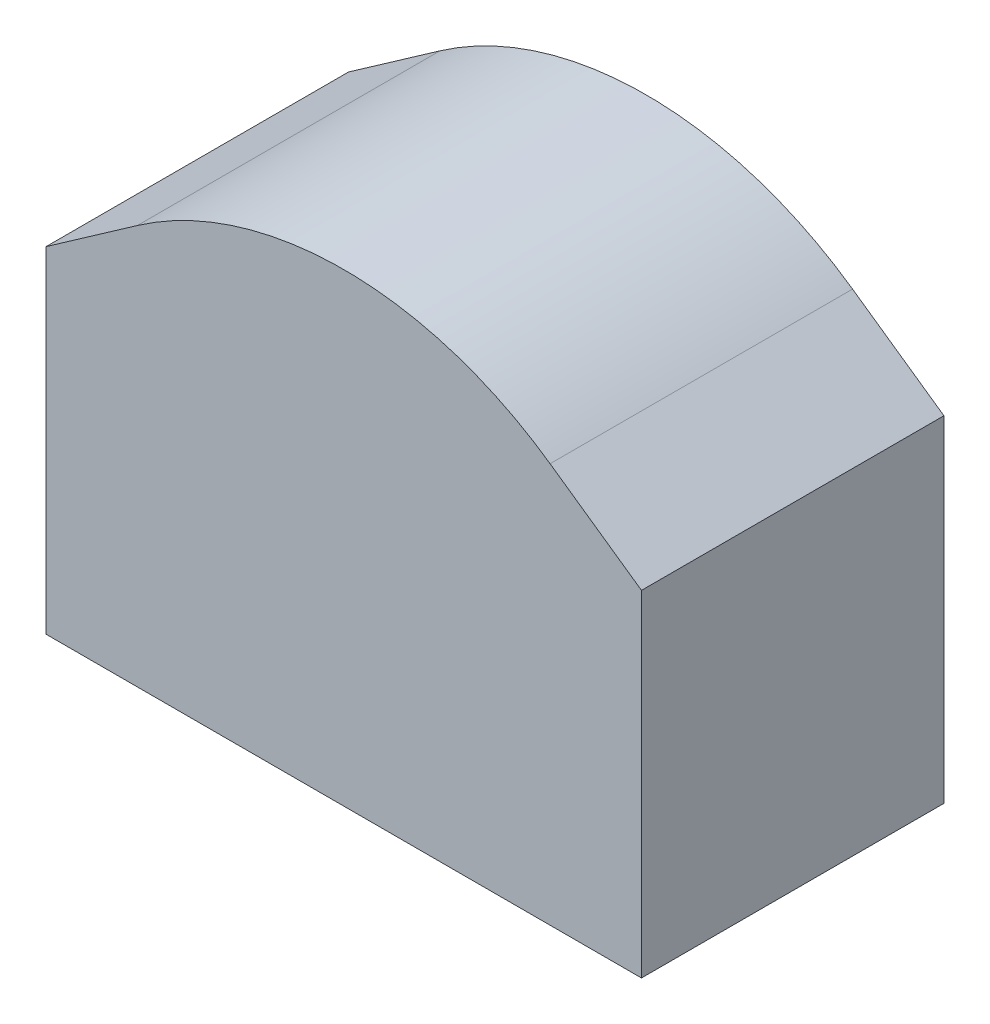
ISO-10303-21;
HEADER;
FILE_DESCRIPTION(('STEP AP214'),'2;1');
FILE_NAME('part.step','',(''),(''),'','','');
FILE_SCHEMA(('AUTOMOTIVE_DESIGN { 1 0 10303 214 1 1 1 1 }'));
ENDSEC;
DATA;
#1=APPLICATION_CONTEXT('core data for automotive mechanical design processes');
#2=APPLICATION_PROTOCOL_DEFINITION('international standard','automotive_design',2000,#1);
#3=PRODUCT_CONTEXT('',#1,'mechanical');
#4=PRODUCT('Part','Part','',(#3));
#5=PRODUCT_RELATED_PRODUCT_CATEGORY('part','',(#4));
#6=PRODUCT_DEFINITION_FORMATION('','',#4);
#7=PRODUCT_DEFINITION_CONTEXT('part definition',#1,'design');
#8=PRODUCT_DEFINITION('design','',#6,#7);
#9=PRODUCT_DEFINITION_SHAPE('','',#8);
#10=(LENGTH_UNIT() NAMED_UNIT(*) SI_UNIT(.MILLI.,.METRE.));
#11=(NAMED_UNIT(*) PLANE_ANGLE_UNIT() SI_UNIT($,.RADIAN.));
#12=(NAMED_UNIT(*) SI_UNIT($,.STERADIAN.) SOLID_ANGLE_UNIT());
#13=UNCERTAINTY_MEASURE_WITH_UNIT(LENGTH_MEASURE(1.E-05),#10,'distance_accuracy_value','');
#14=(GEOMETRIC_REPRESENTATION_CONTEXT(3) GLOBAL_UNCERTAINTY_ASSIGNED_CONTEXT((#13)) GLOBAL_UNIT_ASSIGNED_CONTEXT((#10,
#11,#12)) REPRESENTATION_CONTEXT('',''));
#15=CARTESIAN_POINT('',(0.,0.,0.));
#16=DIRECTION('',(0.,0.,1.));
#17=DIRECTION('',(1.,0.,0.));
#18=AXIS2_PLACEMENT_3D('',#15,#16,#17);
#19=CARTESIAN_POINT('',(-2.50000000000004,1.93701972279378,2.54));
#20=DIRECTION('',(1.,0.,0.));
#21=DIRECTION('',(0.,0.,-1.));
#22=AXIS2_PLACEMENT_3D('',#19,#20,#21);
#23=PLANE('',#22);
#24=DIRECTION('',(0.,-1.,0.));
#25=VECTOR('',#24,1.);
#26=CARTESIAN_POINT('',(-2.50000000000004,1.93701972279378,0.));
#27=LINE('',#26,#25);
#28=CARTESIAN_POINT('',(-2.50000000000004,1.93701972279378,0.));
#29=VERTEX_POINT('',#28);
#30=CARTESIAN_POINT('',(-2.50000000000004,-0.88204324009403,0.));
#31=VERTEX_POINT('',#30);
#32=EDGE_CURVE('E117',#29,#31,#27,.T.);
#33=ORIENTED_EDGE('',*,*,#32,.T.);
#34=DIRECTION('',(0.,0.,-1.));
#35=VECTOR('',#34,1.);
#36=CARTESIAN_POINT('',(-2.50000000000004,-0.88204324009403,2.54));
#37=LINE('',#36,#35);
#38=CARTESIAN_POINT('',(-2.50000000000004,-0.88204324009403,2.54));
#39=VERTEX_POINT('',#38);
#40=EDGE_CURVE('E11',#39,#31,#37,.T.);
#41=ORIENTED_EDGE('',*,*,#40,.F.);
#42=DIRECTION('',(0.,-1.,0.));
#43=VECTOR('',#42,1.);
#44=CARTESIAN_POINT('',(-2.50000000000004,1.93701972279378,2.54));
#45=LINE('',#44,#43);
#46=CARTESIAN_POINT('',(-2.50000000000004,1.93701972279378,2.54));
#47=VERTEX_POINT('',#46);
#48=EDGE_CURVE('E127',#47,#39,#45,.T.);
#49=ORIENTED_EDGE('',*,*,#48,.F.);
#50=DIRECTION('',(0.,0.,-1.));
#51=VECTOR('',#50,1.);
#52=CARTESIAN_POINT('',(-2.50000000000004,1.93701972279378,2.54));
#53=LINE('',#52,#51);
#54=EDGE_CURVE('E113',#47,#29,#53,.T.);
#55=ORIENTED_EDGE('',*,*,#54,.T.);
#56=EDGE_LOOP('',(#33,#41,#49,#55));
#57=FACE_BOUND('',#56,.T.);
#58=ADVANCED_FACE('F33',(#57),#23,.F.);
#59=CARTESIAN_POINT('',(-2.50000000000004,-0.88204324009403,2.54));
#60=DIRECTION('',(0.,1.,0.));
#61=DIRECTION('',(0.,0.,1.));
#62=AXIS2_PLACEMENT_3D('',#59,#60,#61);
#63=PLANE('',#62);
#64=DIRECTION('',(1.,0.,0.));
#65=VECTOR('',#64,1.);
#66=CARTESIAN_POINT('',(-2.50000000000004,-0.88204324009403,0.));
#67=LINE('',#66,#65);
#68=CARTESIAN_POINT('',(2.50000000000004,-0.88204324009403,0.));
#69=VERTEX_POINT('',#68);
#70=EDGE_CURVE('E120',#31,#69,#67,.T.);
#71=ORIENTED_EDGE('',*,*,#70,.T.);
#72=DIRECTION('',(0.,0.,-1.));
#73=VECTOR('',#72,1.);
#74=CARTESIAN_POINT('',(2.50000000000004,-0.88204324009403,2.54));
#75=LINE('',#74,#73);
#76=CARTESIAN_POINT('',(2.50000000000004,-0.88204324009403,2.54));
#77=VERTEX_POINT('',#76);
#78=EDGE_CURVE('E41',#77,#69,#75,.T.);
#79=ORIENTED_EDGE('',*,*,#78,.F.);
#80=DIRECTION('',(1.,0.,0.));
#81=VECTOR('',#80,1.);
#82=CARTESIAN_POINT('',(-2.50000000000004,-0.88204324009403,2.54));
#83=LINE('',#82,#81);
#84=EDGE_CURVE('E85',#39,#77,#83,.T.);
#85=ORIENTED_EDGE('',*,*,#84,.F.);
#86=ORIENTED_EDGE('',*,*,#40,.T.);
#87=EDGE_LOOP('',(#71,#79,#85,#86));
#88=FACE_BOUND('',#87,.T.);
#89=ADVANCED_FACE('F151',(#88),#63,.F.);
#90=CARTESIAN_POINT('',(2.50000000000004,-0.88204324009403,2.54));
#91=DIRECTION('',(-1.,0.,0.));
#92=DIRECTION('',(0.,-1.,0.));
#93=AXIS2_PLACEMENT_3D('',#90,#91,#92);
#94=PLANE('',#93);
#95=DIRECTION('',(0.,1.,0.));
#96=VECTOR('',#95,1.);
#97=CARTESIAN_POINT('',(2.50000000000004,-0.88204324009403,0.));
#98=LINE('',#97,#96);
#99=CARTESIAN_POINT('',(2.50000000000004,1.93701972279378,0.));
#100=VERTEX_POINT('',#99);
#101=EDGE_CURVE('E122',#69,#100,#98,.T.);
#102=ORIENTED_EDGE('',*,*,#101,.T.);
#103=DIRECTION('',(0.,0.,-1.));
#104=VECTOR('',#103,1.);
#105=CARTESIAN_POINT('',(2.50000000000004,1.93701972279378,2.54));
#106=LINE('',#105,#104);
#107=CARTESIAN_POINT('',(2.50000000000004,1.93701972279378,2.54));
#108=VERTEX_POINT('',#107);
#109=EDGE_CURVE('E108',#108,#100,#106,.T.);
#110=ORIENTED_EDGE('',*,*,#109,.F.);
#111=DIRECTION('',(0.,1.,0.));
#112=VECTOR('',#111,1.);
#113=CARTESIAN_POINT('',(2.50000000000004,-0.88204324009403,2.54));
#114=LINE('',#113,#112);
#115=EDGE_CURVE('E98',#77,#108,#114,.T.);
#116=ORIENTED_EDGE('',*,*,#115,.F.);
#117=ORIENTED_EDGE('',*,*,#78,.T.);
#118=EDGE_LOOP('',(#102,#110,#116,#117));
#119=FACE_BOUND('',#118,.T.);
#120=ADVANCED_FACE('F133',(#119),#94,.F.);
#121=CARTESIAN_POINT('',(2.50000000000004,1.93701972279378,2.54));
#122=DIRECTION('',(-0.573576436351066,-0.819152044288978,0.));
#123=DIRECTION('',(0.819152044288978,-0.573576436351066,0.));
#124=AXIS2_PLACEMENT_3D('',#121,#122,#123);
#125=PLANE('',#124);
#126=DIRECTION('',(-0.819152044288978,0.573576436351066,0.));
#127=VECTOR('',#126,1.);
#128=CARTESIAN_POINT('',(2.50000000000004,1.93701972279378,0.));
#129=LINE('',#128,#127);
#130=CARTESIAN_POINT('',(1.73257639075604,2.47437551898656,0.));
#131=VERTEX_POINT('',#130);
#132=EDGE_CURVE('E107',#100,#131,#129,.T.);
#133=ORIENTED_EDGE('',*,*,#132,.T.);
#134=DIRECTION('',(0.,0.,-1.));
#135=VECTOR('',#134,1.);
#136=CARTESIAN_POINT('',(1.73257639075604,2.47437551898656,2.54));
#137=LINE('',#136,#135);
#138=CARTESIAN_POINT('',(1.73257639075604,2.47437551898656,2.54));
#139=VERTEX_POINT('',#138);
#140=EDGE_CURVE('E104',#139,#131,#137,.T.);
#141=ORIENTED_EDGE('',*,*,#140,.F.);
#142=DIRECTION('',(-0.819152044288978,0.573576436351066,0.));
#143=VECTOR('',#142,1.);
#144=CARTESIAN_POINT('',(2.50000000000004,1.93701972279378,2.54));
#145=LINE('',#144,#143);
#146=EDGE_CURVE('E92',#108,#139,#145,.T.);
#147=ORIENTED_EDGE('',*,*,#146,.F.);
#148=ORIENTED_EDGE('',*,*,#109,.T.);
#149=EDGE_LOOP('',(#133,#141,#147,#148));
#150=FACE_BOUND('',#149,.T.);
#151=ADVANCED_FACE('F105',(#150),#125,.F.);
#152=CARTESIAN_POINT('',(0.,0.,2.54));
#153=DIRECTION('',(0.,0.,-1.));
#154=DIRECTION('',(-1.,0.,0.));
#155=AXIS2_PLACEMENT_3D('',#152,#153,#154);
#156=CYLINDRICAL_SURFACE('',#155,3.02065475663228);
#157=CARTESIAN_POINT('',(0.,0.,0.));
#158=DIRECTION('',(0.,0.,1.));
#159=DIRECTION('',(1.,0.,0.));
#160=AXIS2_PLACEMENT_3D('',#157,#158,#159);
#161=CIRCLE('',#160,3.02065475663228);
#162=CARTESIAN_POINT('',(-1.73257639075604,2.47437551898656,0.));
#163=VERTEX_POINT('',#162);
#164=EDGE_CURVE('E71',#131,#163,#161,.T.);
#165=ORIENTED_EDGE('',*,*,#164,.T.);
#166=DIRECTION('',(0.,0.,-1.));
#167=VECTOR('',#166,1.);
#168=CARTESIAN_POINT('',(-1.73257639075604,2.47437551898656,2.54));
#169=LINE('',#168,#167);
#170=CARTESIAN_POINT('',(-1.73257639075604,2.47437551898656,2.54));
#171=VERTEX_POINT('',#170);
#172=EDGE_CURVE('E109',#171,#163,#169,.T.);
#173=ORIENTED_EDGE('',*,*,#172,.F.);
#174=CARTESIAN_POINT('',(0.,0.,2.54));
#175=DIRECTION('',(0.,0.,1.));
#176=DIRECTION('',(1.,0.,0.));
#177=AXIS2_PLACEMENT_3D('',#174,#175,#176);
#178=CIRCLE('',#177,3.02065475663228);
#179=EDGE_CURVE('E96',#139,#171,#178,.T.);
#180=ORIENTED_EDGE('',*,*,#179,.F.);
#181=ORIENTED_EDGE('',*,*,#140,.T.);
#182=EDGE_LOOP('',(#165,#173,#180,#181));
#183=FACE_BOUND('',#182,.T.);
#184=ADVANCED_FACE('F111',(#183),#156,.T.);
#185=CARTESIAN_POINT('',(-1.73257639075604,2.47437551898656,2.54));
#186=DIRECTION('',(0.573576436351066,-0.819152044288978,0.));
#187=DIRECTION('',(0.819152044288978,0.573576436351066,0.));
#188=AXIS2_PLACEMENT_3D('',#185,#186,#187);
#189=PLANE('',#188);
#190=DIRECTION('',(-0.819152044288978,-0.573576436351066,0.));
#191=VECTOR('',#190,1.);
#192=CARTESIAN_POINT('',(-1.73257639075604,2.47437551898656,0.));
#193=LINE('',#192,#191);
#194=EDGE_CURVE('E77',#163,#29,#193,.T.);
#195=ORIENTED_EDGE('',*,*,#194,.T.);
#196=ORIENTED_EDGE('',*,*,#54,.F.);
#197=DIRECTION('',(-0.819152044288978,-0.573576436351066,0.));
#198=VECTOR('',#197,1.);
#199=CARTESIAN_POINT('',(-1.73257639075604,2.47437551898656,2.54));
#200=LINE('',#199,#198);
#201=EDGE_CURVE('E49',#171,#47,#200,.T.);
#202=ORIENTED_EDGE('',*,*,#201,.F.);
#203=ORIENTED_EDGE('',*,*,#172,.T.);
#204=EDGE_LOOP('',(#195,#196,#202,#203));
#205=FACE_BOUND('',#204,.T.);
#206=ADVANCED_FACE('F140',(#205),#189,.F.);
#207=CARTESIAN_POINT('',(0.,0.,2.54));
#208=DIRECTION('',(0.,0.,1.));
#209=DIRECTION('',(1.,0.,0.));
#210=AXIS2_PLACEMENT_3D('',#207,#208,#209);
#211=PLANE('',#210);
#212=ORIENTED_EDGE('',*,*,#48,.T.);
#213=ORIENTED_EDGE('',*,*,#84,.T.);
#214=ORIENTED_EDGE('',*,*,#115,.T.);
#215=ORIENTED_EDGE('',*,*,#146,.T.);
#216=ORIENTED_EDGE('',*,*,#179,.T.);
#217=ORIENTED_EDGE('',*,*,#201,.T.);
#218=EDGE_LOOP('',(#212,#213,#214,#215,#216,#217));
#219=FACE_BOUND('',#218,.T.);
#220=ADVANCED_FACE('F94',(#219),#211,.T.);
#221=CARTESIAN_POINT('',(0.,0.,0.));
#222=DIRECTION('',(0.,0.,1.));
#223=DIRECTION('',(1.,0.,0.));
#224=AXIS2_PLACEMENT_3D('',#221,#222,#223);
#225=PLANE('',#224);
#226=ORIENTED_EDGE('',*,*,#32,.F.);
#227=ORIENTED_EDGE('',*,*,#194,.F.);
#228=ORIENTED_EDGE('',*,*,#164,.F.);
#229=ORIENTED_EDGE('',*,*,#132,.F.);
#230=ORIENTED_EDGE('',*,*,#101,.F.);
#231=ORIENTED_EDGE('',*,*,#70,.F.);
#232=EDGE_LOOP('',(#226,#227,#228,#229,#230,#231));
#233=FACE_BOUND('',#232,.T.);
#234=ADVANCED_FACE('F136',(#233),#225,.F.);
#235=CLOSED_SHELL('',(#58,#89,#120,#151,#184,#206,#220,#234));
#236=MANIFOLD_SOLID_BREP('B2',#235);
#237=ADVANCED_BREP_SHAPE_REPRESENTATION('',(#18,#236),#14);
#238=SHAPE_DEFINITION_REPRESENTATION(#9,#237);
ENDSEC;
END-ISO-10303-21;
